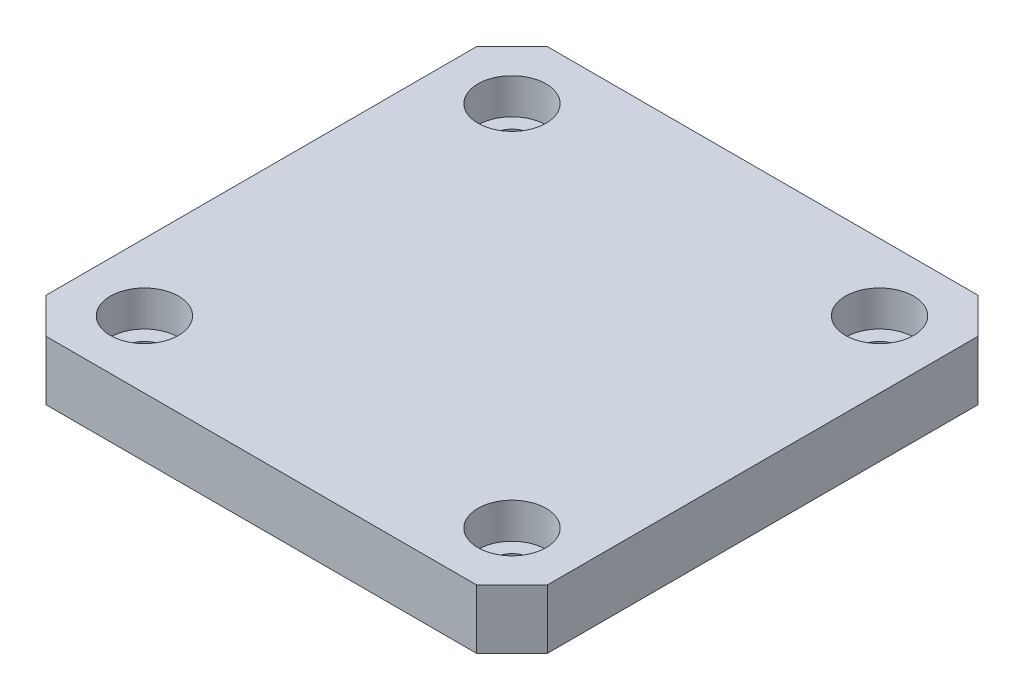
ISO-10303-21;
HEADER;
FILE_DESCRIPTION(('STEP AP214'),'2;1');
FILE_NAME('part.step','',(''),(''),'','','');
FILE_SCHEMA(('AUTOMOTIVE_DESIGN { 1 0 10303 214 1 1 1 1 }'));
ENDSEC;
DATA;
#1=APPLICATION_CONTEXT('core data for automotive mechanical design processes');
#2=APPLICATION_PROTOCOL_DEFINITION('international standard','automotive_design',2000,#1);
#3=PRODUCT_CONTEXT('',#1,'mechanical');
#4=PRODUCT('Part','Part','',(#3));
#5=PRODUCT_RELATED_PRODUCT_CATEGORY('part','',(#4));
#6=PRODUCT_DEFINITION_FORMATION('','',#4);
#7=PRODUCT_DEFINITION_CONTEXT('part definition',#1,'design');
#8=PRODUCT_DEFINITION('design','',#6,#7);
#9=PRODUCT_DEFINITION_SHAPE('','',#8);
#10=(LENGTH_UNIT() NAMED_UNIT(*) SI_UNIT(.MILLI.,.METRE.));
#11=(NAMED_UNIT(*) PLANE_ANGLE_UNIT() SI_UNIT($,.RADIAN.));
#12=(NAMED_UNIT(*) SI_UNIT($,.STERADIAN.) SOLID_ANGLE_UNIT());
#13=UNCERTAINTY_MEASURE_WITH_UNIT(LENGTH_MEASURE(1.E-05),#10,'distance_accuracy_value','');
#14=(GEOMETRIC_REPRESENTATION_CONTEXT(3) GLOBAL_UNCERTAINTY_ASSIGNED_CONTEXT((#13)) GLOBAL_UNIT_ASSIGNED_CONTEXT((#10,
#11,#12)) REPRESENTATION_CONTEXT('',''));
#15=CARTESIAN_POINT('',(0.,0.,0.));
#16=DIRECTION('',(0.,0.,1.));
#17=DIRECTION('',(1.,0.,0.));
#18=AXIS2_PLACEMENT_3D('',#15,#16,#17);
#19=CARTESIAN_POINT('',(0.,48.,0.));
#20=DIRECTION('',(0.,1.,0.));
#21=DIRECTION('',(1.,0.,0.));
#22=AXIS2_PLACEMENT_3D('',#19,#20,#21);
#23=PLANE('',#22);
#24=CARTESIAN_POINT('',(0.,48.,0.));
#25=DIRECTION('',(0.,1.,0.));
#26=DIRECTION('',(1.,0.,0.));
#27=AXIS2_PLACEMENT_3D('',#24,#25,#26);
#28=CIRCLE('',#27,11.);
#29=CARTESIAN_POINT('',(-11.,48.,0.));
#30=VERTEX_POINT('',#29);
#31=EDGE_CURVE('E272',#30,#30,#28,.T.);
#32=ORIENTED_EDGE('',*,*,#31,.T.);
#33=EDGE_LOOP('',(#32));
#34=FACE_BOUND('',#33,.T.);
#35=CARTESIAN_POINT('',(-15.5,48.,15.5));
#36=DIRECTION('',(0.,1.,0.));
#37=DIRECTION('',(0.,0.,1.));
#38=AXIS2_PLACEMENT_3D('',#35,#36,#37);
#39=CIRCLE('',#38,1.6);
#40=CARTESIAN_POINT('',(-15.5,48.,17.1));
#41=VERTEX_POINT('',#40);
#42=CARTESIAN_POINT('',(-15.5,48.,13.9));
#43=VERTEX_POINT('',#42);
#44=EDGE_CURVE('E319',#41,#43,#39,.T.);
#45=ORIENTED_EDGE('',*,*,#44,.T.);
#46=CARTESIAN_POINT('',(-15.5,48.,15.5));
#47=DIRECTION('',(0.,1.,0.));
#48=DIRECTION('',(0.,0.,1.));
#49=AXIS2_PLACEMENT_3D('',#46,#47,#48);
#50=CIRCLE('',#49,1.6);
#51=EDGE_CURVE('E276',#43,#41,#50,.T.);
#52=ORIENTED_EDGE('',*,*,#51,.T.);
#53=EDGE_LOOP('',(#45,#52));
#54=FACE_BOUND('',#53,.T.);
#55=CARTESIAN_POINT('',(-15.5,48.,-15.5));
#56=DIRECTION('',(0.,1.,0.));
#57=DIRECTION('',(0.,0.,1.));
#58=AXIS2_PLACEMENT_3D('',#55,#56,#57);
#59=CIRCLE('',#58,1.6);
#60=CARTESIAN_POINT('',(-15.5,48.,-13.9));
#61=VERTEX_POINT('',#60);
#62=CARTESIAN_POINT('',(-15.5,48.,-17.1));
#63=VERTEX_POINT('',#62);
#64=EDGE_CURVE('E294',#61,#63,#59,.T.);
#65=ORIENTED_EDGE('',*,*,#64,.T.);
#66=CARTESIAN_POINT('',(-15.5,48.,-15.5));
#67=DIRECTION('',(0.,1.,0.));
#68=DIRECTION('',(0.,0.,1.));
#69=AXIS2_PLACEMENT_3D('',#66,#67,#68);
#70=CIRCLE('',#69,1.6);
#71=EDGE_CURVE('E396',#63,#61,#70,.T.);
#72=ORIENTED_EDGE('',*,*,#71,.T.);
#73=EDGE_LOOP('',(#65,#72));
#74=FACE_BOUND('',#73,.T.);
#75=CARTESIAN_POINT('',(15.5,48.,15.5));
#76=DIRECTION('',(0.,1.,0.));
#77=DIRECTION('',(0.,0.,1.));
#78=AXIS2_PLACEMENT_3D('',#75,#76,#77);
#79=CIRCLE('',#78,1.6);
#80=CARTESIAN_POINT('',(15.5,48.,17.1));
#81=VERTEX_POINT('',#80);
#82=CARTESIAN_POINT('',(15.5,48.,13.9));
#83=VERTEX_POINT('',#82);
#84=EDGE_CURVE('E265',#81,#83,#79,.T.);
#85=ORIENTED_EDGE('',*,*,#84,.T.);
#86=CARTESIAN_POINT('',(15.5,48.,15.5));
#87=DIRECTION('',(0.,1.,0.));
#88=DIRECTION('',(0.,0.,1.));
#89=AXIS2_PLACEMENT_3D('',#86,#87,#88);
#90=CIRCLE('',#89,1.6);
#91=EDGE_CURVE('E261',#83,#81,#90,.T.);
#92=ORIENTED_EDGE('',*,*,#91,.T.);
#93=EDGE_LOOP('',(#85,#92));
#94=FACE_BOUND('',#93,.T.);
#95=CARTESIAN_POINT('',(15.5,48.,-15.5));
#96=DIRECTION('',(0.,1.,0.));
#97=DIRECTION('',(0.,0.,1.));
#98=AXIS2_PLACEMENT_3D('',#95,#96,#97);
#99=CIRCLE('',#98,1.6);
#100=CARTESIAN_POINT('',(15.5,48.,-13.9));
#101=VERTEX_POINT('',#100);
#102=CARTESIAN_POINT('',(15.5,48.,-17.1));
#103=VERTEX_POINT('',#102);
#104=EDGE_CURVE('E368',#101,#103,#99,.T.);
#105=ORIENTED_EDGE('',*,*,#104,.T.);
#106=CARTESIAN_POINT('',(15.5,48.,-15.5));
#107=DIRECTION('',(0.,1.,0.));
#108=DIRECTION('',(0.,0.,1.));
#109=AXIS2_PLACEMENT_3D('',#106,#107,#108);
#110=CIRCLE('',#109,1.6);
#111=EDGE_CURVE('E342',#103,#101,#110,.T.);
#112=ORIENTED_EDGE('',*,*,#111,.T.);
#113=EDGE_LOOP('',(#105,#112));
#114=FACE_BOUND('',#113,.T.);
#115=DIRECTION('',(0.,0.,-1.));
#116=VECTOR('',#115,1.);
#117=CARTESIAN_POINT('',(21.15,48.,18.15));
#118=LINE('',#117,#116);
#119=CARTESIAN_POINT('',(21.15,48.,18.15));
#120=VERTEX_POINT('',#119);
#121=CARTESIAN_POINT('',(21.15,48.,-18.15));
#122=VERTEX_POINT('',#121);
#123=EDGE_CURVE('E27',#120,#122,#118,.T.);
#124=ORIENTED_EDGE('',*,*,#123,.F.);
#125=DIRECTION('',(0.707106781186531,0.,-0.707106781186564));
#126=VECTOR('',#125,1.);
#127=CARTESIAN_POINT('',(18.15,48.,21.15));
#128=LINE('',#127,#126);
#129=CARTESIAN_POINT('',(18.15,48.,21.15));
#130=VERTEX_POINT('',#129);
#131=EDGE_CURVE('E215',#130,#120,#128,.T.);
#132=ORIENTED_EDGE('',*,*,#131,.F.);
#133=DIRECTION('',(1.,0.,0.));
#134=VECTOR('',#133,1.);
#135=CARTESIAN_POINT('',(-18.15,48.,21.15));
#136=LINE('',#135,#134);
#137=CARTESIAN_POINT('',(-18.15,48.,21.15));
#138=VERTEX_POINT('',#137);
#139=EDGE_CURVE('E290',#138,#130,#136,.T.);
#140=ORIENTED_EDGE('',*,*,#139,.F.);
#141=DIRECTION('',(0.707106781186548,0.,0.707106781186548));
#142=VECTOR('',#141,1.);
#143=CARTESIAN_POINT('',(-21.15,48.,18.15));
#144=LINE('',#143,#142);
#145=CARTESIAN_POINT('',(-21.15,48.,18.15));
#146=VERTEX_POINT('',#145);
#147=EDGE_CURVE('E277',#146,#138,#144,.T.);
#148=ORIENTED_EDGE('',*,*,#147,.F.);
#149=DIRECTION('',(0.,0.,1.));
#150=VECTOR('',#149,1.);
#151=CARTESIAN_POINT('',(-21.15,48.,-18.15));
#152=LINE('',#151,#150);
#153=CARTESIAN_POINT('',(-21.15,48.,-18.15));
#154=VERTEX_POINT('',#153);
#155=EDGE_CURVE('E363',#154,#146,#152,.T.);
#156=ORIENTED_EDGE('',*,*,#155,.F.);
#157=DIRECTION('',(-0.707106781186548,0.,0.707106781186548));
#158=VECTOR('',#157,1.);
#159=CARTESIAN_POINT('',(-18.15,48.,-21.15));
#160=LINE('',#159,#158);
#161=CARTESIAN_POINT('',(-18.15,48.,-21.15));
#162=VERTEX_POINT('',#161);
#163=EDGE_CURVE('E297',#162,#154,#160,.T.);
#164=ORIENTED_EDGE('',*,*,#163,.F.);
#165=DIRECTION('',(-1.,0.,0.));
#166=VECTOR('',#165,1.);
#167=CARTESIAN_POINT('',(18.15,48.,-21.15));
#168=LINE('',#167,#166);
#169=CARTESIAN_POINT('',(18.15,48.,-21.15));
#170=VERTEX_POINT('',#169);
#171=EDGE_CURVE('E247',#170,#162,#168,.T.);
#172=ORIENTED_EDGE('',*,*,#171,.F.);
#173=DIRECTION('',(-0.707106781186531,0.,-0.707106781186564));
#174=VECTOR('',#173,1.);
#175=CARTESIAN_POINT('',(21.15,48.,-18.15));
#176=LINE('',#175,#174);
#177=EDGE_CURVE('E172',#122,#170,#176,.T.);
#178=ORIENTED_EDGE('',*,*,#177,.F.);
#179=EDGE_LOOP('',(#124,#132,#140,#148,#156,#164,#172,#178));
#180=FACE_BOUND('',#179,.T.);
#181=ADVANCED_FACE('F16',(#34,#54,#74,#94,#114,#180),#23,.F.);
#182=CARTESIAN_POINT('',(0.,53.,0.));
#183=DIRECTION('',(0.,1.,0.));
#184=DIRECTION('',(1.,0.,0.));
#185=AXIS2_PLACEMENT_3D('',#182,#183,#184);
#186=PLANE('',#185);
#187=CARTESIAN_POINT('',(-15.5,53.,15.5));
#188=DIRECTION('',(0.,-1.,0.));
#189=DIRECTION('',(0.,0.,1.));
#190=AXIS2_PLACEMENT_3D('',#187,#188,#189);
#191=CIRCLE('',#190,2.875);
#192=CARTESIAN_POINT('',(-15.5,53.,18.375));
#193=VERTEX_POINT('',#192);
#194=CARTESIAN_POINT('',(-15.5,53.,12.625));
#195=VERTEX_POINT('',#194);
#196=EDGE_CURVE('E266',#193,#195,#191,.T.);
#197=ORIENTED_EDGE('',*,*,#196,.T.);
#198=CARTESIAN_POINT('',(-15.5,53.,15.5));
#199=DIRECTION('',(0.,-1.,0.));
#200=DIRECTION('',(0.,0.,1.));
#201=AXIS2_PLACEMENT_3D('',#198,#199,#200);
#202=CIRCLE('',#201,2.875);
#203=EDGE_CURVE('E270',#195,#193,#202,.T.);
#204=ORIENTED_EDGE('',*,*,#203,.T.);
#205=EDGE_LOOP('',(#197,#204));
#206=FACE_BOUND('',#205,.T.);
#207=CARTESIAN_POINT('',(-15.5,53.,-15.5));
#208=DIRECTION('',(0.,-1.,0.));
#209=DIRECTION('',(0.,0.,1.));
#210=AXIS2_PLACEMENT_3D('',#207,#208,#209);
#211=CIRCLE('',#210,2.875);
#212=CARTESIAN_POINT('',(-15.5,53.,-12.625));
#213=VERTEX_POINT('',#212);
#214=CARTESIAN_POINT('',(-15.5,53.,-18.375));
#215=VERTEX_POINT('',#214);
#216=EDGE_CURVE('E336',#213,#215,#211,.T.);
#217=ORIENTED_EDGE('',*,*,#216,.T.);
#218=CARTESIAN_POINT('',(-15.5,53.,-15.5));
#219=DIRECTION('',(0.,-1.,0.));
#220=DIRECTION('',(0.,0.,1.));
#221=AXIS2_PLACEMENT_3D('',#218,#219,#220);
#222=CIRCLE('',#221,2.875);
#223=EDGE_CURVE('E333',#215,#213,#222,.T.);
#224=ORIENTED_EDGE('',*,*,#223,.T.);
#225=EDGE_LOOP('',(#217,#224));
#226=FACE_BOUND('',#225,.T.);
#227=CARTESIAN_POINT('',(15.5,53.,15.5));
#228=DIRECTION('',(0.,-1.,0.));
#229=DIRECTION('',(0.,0.,1.));
#230=AXIS2_PLACEMENT_3D('',#227,#228,#229);
#231=CIRCLE('',#230,2.875);
#232=CARTESIAN_POINT('',(15.5,53.,18.375));
#233=VERTEX_POINT('',#232);
#234=CARTESIAN_POINT('',(15.5,53.,12.625));
#235=VERTEX_POINT('',#234);
#236=EDGE_CURVE('E250',#233,#235,#231,.T.);
#237=ORIENTED_EDGE('',*,*,#236,.T.);
#238=CARTESIAN_POINT('',(15.5,53.,15.5));
#239=DIRECTION('',(0.,-1.,0.));
#240=DIRECTION('',(0.,0.,1.));
#241=AXIS2_PLACEMENT_3D('',#238,#239,#240);
#242=CIRCLE('',#241,2.875);
#243=EDGE_CURVE('E254',#235,#233,#242,.T.);
#244=ORIENTED_EDGE('',*,*,#243,.T.);
#245=EDGE_LOOP('',(#237,#244));
#246=FACE_BOUND('',#245,.T.);
#247=CARTESIAN_POINT('',(15.5,53.,-15.5));
#248=DIRECTION('',(0.,-1.,0.));
#249=DIRECTION('',(0.,0.,1.));
#250=AXIS2_PLACEMENT_3D('',#247,#248,#249);
#251=CIRCLE('',#250,2.875);
#252=CARTESIAN_POINT('',(15.5,53.,-12.625));
#253=VERTEX_POINT('',#252);
#254=CARTESIAN_POINT('',(15.5,53.,-18.375));
#255=VERTEX_POINT('',#254);
#256=EDGE_CURVE('E282',#253,#255,#251,.T.);
#257=ORIENTED_EDGE('',*,*,#256,.T.);
#258=CARTESIAN_POINT('',(15.5,53.,-15.5));
#259=DIRECTION('',(0.,-1.,0.));
#260=DIRECTION('',(0.,0.,1.));
#261=AXIS2_PLACEMENT_3D('',#258,#259,#260);
#262=CIRCLE('',#261,2.875);
#263=EDGE_CURVE('E20',#255,#253,#262,.T.);
#264=ORIENTED_EDGE('',*,*,#263,.T.);
#265=EDGE_LOOP('',(#257,#264));
#266=FACE_BOUND('',#265,.T.);
#267=DIRECTION('',(0.,0.,-1.));
#268=VECTOR('',#267,1.);
#269=CARTESIAN_POINT('',(21.15,53.,18.15));
#270=LINE('',#269,#268);
#271=CARTESIAN_POINT('',(21.15,53.,18.15));
#272=VERTEX_POINT('',#271);
#273=CARTESIAN_POINT('',(21.15,53.,-18.15));
#274=VERTEX_POINT('',#273);
#275=EDGE_CURVE('E11',#272,#274,#270,.T.);
#276=ORIENTED_EDGE('',*,*,#275,.T.);
#277=DIRECTION('',(-0.707106781186531,0.,-0.707106781186564));
#278=VECTOR('',#277,1.);
#279=CARTESIAN_POINT('',(21.15,53.,-18.15));
#280=LINE('',#279,#278);
#281=CARTESIAN_POINT('',(18.15,53.,-21.15));
#282=VERTEX_POINT('',#281);
#283=EDGE_CURVE('E332',#274,#282,#280,.T.);
#284=ORIENTED_EDGE('',*,*,#283,.T.);
#285=DIRECTION('',(-1.,0.,0.));
#286=VECTOR('',#285,1.);
#287=CARTESIAN_POINT('',(18.15,53.,-21.15));
#288=LINE('',#287,#286);
#289=CARTESIAN_POINT('',(-18.15,53.,-21.15));
#290=VERTEX_POINT('',#289);
#291=EDGE_CURVE('E184',#282,#290,#288,.T.);
#292=ORIENTED_EDGE('',*,*,#291,.T.);
#293=DIRECTION('',(-0.707106781186548,0.,0.707106781186548));
#294=VECTOR('',#293,1.);
#295=CARTESIAN_POINT('',(-18.15,53.,-21.15));
#296=LINE('',#295,#294);
#297=CARTESIAN_POINT('',(-21.15,53.,-18.15));
#298=VERTEX_POINT('',#297);
#299=EDGE_CURVE('E248',#290,#298,#296,.T.);
#300=ORIENTED_EDGE('',*,*,#299,.T.);
#301=DIRECTION('',(0.,0.,1.));
#302=VECTOR('',#301,1.);
#303=CARTESIAN_POINT('',(-21.15,53.,-18.15));
#304=LINE('',#303,#302);
#305=CARTESIAN_POINT('',(-21.15,53.,18.15));
#306=VERTEX_POINT('',#305);
#307=EDGE_CURVE('E366',#298,#306,#304,.T.);
#308=ORIENTED_EDGE('',*,*,#307,.T.);
#309=DIRECTION('',(0.707106781186548,0.,0.707106781186548));
#310=VECTOR('',#309,1.);
#311=CARTESIAN_POINT('',(-21.15,53.,18.15));
#312=LINE('',#311,#310);
#313=CARTESIAN_POINT('',(-18.15,53.,21.15));
#314=VERTEX_POINT('',#313);
#315=EDGE_CURVE('E280',#306,#314,#312,.T.);
#316=ORIENTED_EDGE('',*,*,#315,.T.);
#317=DIRECTION('',(1.,0.,0.));
#318=VECTOR('',#317,1.);
#319=CARTESIAN_POINT('',(-18.15,53.,21.15));
#320=LINE('',#319,#318);
#321=CARTESIAN_POINT('',(18.15,53.,21.15));
#322=VERTEX_POINT('',#321);
#323=EDGE_CURVE('E287',#314,#322,#320,.T.);
#324=ORIENTED_EDGE('',*,*,#323,.T.);
#325=DIRECTION('',(0.707106781186531,0.,-0.707106781186564));
#326=VECTOR('',#325,1.);
#327=CARTESIAN_POINT('',(18.15,53.,21.15));
#328=LINE('',#327,#326);
#329=EDGE_CURVE('E227',#322,#272,#328,.T.);
#330=ORIENTED_EDGE('',*,*,#329,.T.);
#331=EDGE_LOOP('',(#276,#284,#292,#300,#308,#316,#324,#330));
#332=FACE_BOUND('',#331,.T.);
#333=ADVANCED_FACE('F432',(#206,#226,#246,#266,#332),#186,.T.);
#334=CARTESIAN_POINT('',(21.15,48.,18.15));
#335=DIRECTION('',(1.,0.,0.));
#336=DIRECTION('',(0.,1.,0.));
#337=AXIS2_PLACEMENT_3D('',#334,#335,#336);
#338=PLANE('',#337);
#339=ORIENTED_EDGE('',*,*,#123,.T.);
#340=DIRECTION('',(0.,1.,0.));
#341=VECTOR('',#340,1.);
#342=CARTESIAN_POINT('',(21.15,48.,-18.15));
#343=LINE('',#342,#341);
#344=EDGE_CURVE('E219',#122,#274,#343,.T.);
#345=ORIENTED_EDGE('',*,*,#344,.T.);
#346=ORIENTED_EDGE('',*,*,#275,.F.);
#347=DIRECTION('',(0.,1.,0.));
#348=VECTOR('',#347,1.);
#349=CARTESIAN_POINT('',(21.15,48.,18.15));
#350=LINE('',#349,#348);
#351=EDGE_CURVE('E222',#120,#272,#350,.T.);
#352=ORIENTED_EDGE('',*,*,#351,.F.);
#353=EDGE_LOOP('',(#339,#345,#346,#352));
#354=FACE_BOUND('',#353,.T.);
#355=ADVANCED_FACE('F223',(#354),#338,.T.);
#356=CARTESIAN_POINT('',(21.15,48.,-18.15));
#357=DIRECTION('',(0.707106781186564,0.,-0.707106781186531));
#358=DIRECTION('',(0.,-1.,0.));
#359=AXIS2_PLACEMENT_3D('',#356,#357,#358);
#360=PLANE('',#359);
#361=ORIENTED_EDGE('',*,*,#177,.T.);
#362=DIRECTION('',(0.,1.,0.));
#363=VECTOR('',#362,1.);
#364=CARTESIAN_POINT('',(18.15,48.,-21.15));
#365=LINE('',#364,#363);
#366=EDGE_CURVE('E303',#170,#282,#365,.T.);
#367=ORIENTED_EDGE('',*,*,#366,.T.);
#368=ORIENTED_EDGE('',*,*,#283,.F.);
#369=ORIENTED_EDGE('',*,*,#344,.F.);
#370=EDGE_LOOP('',(#361,#367,#368,#369));
#371=FACE_BOUND('',#370,.T.);
#372=ADVANCED_FACE('F431',(#371),#360,.T.);
#373=CARTESIAN_POINT('',(18.15,48.,-21.15));
#374=DIRECTION('',(0.,0.,-1.));
#375=DIRECTION('',(0.,-1.,0.));
#376=AXIS2_PLACEMENT_3D('',#373,#374,#375);
#377=PLANE('',#376);
#378=ORIENTED_EDGE('',*,*,#171,.T.);
#379=DIRECTION('',(0.,1.,0.));
#380=VECTOR('',#379,1.);
#381=CARTESIAN_POINT('',(-18.15,48.,-21.15));
#382=LINE('',#381,#380);
#383=EDGE_CURVE('E245',#162,#290,#382,.T.);
#384=ORIENTED_EDGE('',*,*,#383,.T.);
#385=ORIENTED_EDGE('',*,*,#291,.F.);
#386=ORIENTED_EDGE('',*,*,#366,.F.);
#387=EDGE_LOOP('',(#378,#384,#385,#386));
#388=FACE_BOUND('',#387,.T.);
#389=ADVANCED_FACE('F18',(#388),#377,.T.);
#390=CARTESIAN_POINT('',(-18.15,48.,-21.15));
#391=DIRECTION('',(-0.707106781186548,0.,-0.707106781186548));
#392=DIRECTION('',(-0.707106781186548,0.,0.707106781186548));
#393=AXIS2_PLACEMENT_3D('',#390,#391,#392);
#394=PLANE('',#393);
#395=ORIENTED_EDGE('',*,*,#163,.T.);
#396=DIRECTION('',(0.,1.,0.));
#397=VECTOR('',#396,1.);
#398=CARTESIAN_POINT('',(-21.15,48.,-18.15));
#399=LINE('',#398,#397);
#400=EDGE_CURVE('E300',#154,#298,#399,.T.);
#401=ORIENTED_EDGE('',*,*,#400,.T.);
#402=ORIENTED_EDGE('',*,*,#299,.F.);
#403=ORIENTED_EDGE('',*,*,#383,.F.);
#404=EDGE_LOOP('',(#395,#401,#402,#403));
#405=FACE_BOUND('',#404,.T.);
#406=ADVANCED_FACE('F483',(#405),#394,.T.);
#407=CARTESIAN_POINT('',(-21.15,48.,-18.15));
#408=DIRECTION('',(-1.,0.,0.));
#409=DIRECTION('',(0.,0.,1.));
#410=AXIS2_PLACEMENT_3D('',#407,#408,#409);
#411=PLANE('',#410);
#412=ORIENTED_EDGE('',*,*,#155,.T.);
#413=DIRECTION('',(0.,1.,0.));
#414=VECTOR('',#413,1.);
#415=CARTESIAN_POINT('',(-21.15,48.,18.15));
#416=LINE('',#415,#414);
#417=EDGE_CURVE('E367',#146,#306,#416,.T.);
#418=ORIENTED_EDGE('',*,*,#417,.T.);
#419=ORIENTED_EDGE('',*,*,#307,.F.);
#420=ORIENTED_EDGE('',*,*,#400,.F.);
#421=EDGE_LOOP('',(#412,#418,#419,#420));
#422=FACE_BOUND('',#421,.T.);
#423=ADVANCED_FACE('F479',(#422),#411,.T.);
#424=CARTESIAN_POINT('',(-21.15,48.,18.15));
#425=DIRECTION('',(-0.707106781186548,0.,0.707106781186548));
#426=DIRECTION('',(0.,1.,0.));
#427=AXIS2_PLACEMENT_3D('',#424,#425,#426);
#428=PLANE('',#427);
#429=ORIENTED_EDGE('',*,*,#147,.T.);
#430=DIRECTION('',(0.,1.,0.));
#431=VECTOR('',#430,1.);
#432=CARTESIAN_POINT('',(-18.15,48.,21.15));
#433=LINE('',#432,#431);
#434=EDGE_CURVE('E281',#138,#314,#433,.T.);
#435=ORIENTED_EDGE('',*,*,#434,.T.);
#436=ORIENTED_EDGE('',*,*,#315,.F.);
#437=ORIENTED_EDGE('',*,*,#417,.F.);
#438=EDGE_LOOP('',(#429,#435,#436,#437));
#439=FACE_BOUND('',#438,.T.);
#440=ADVANCED_FACE('F482',(#439),#428,.T.);
#441=CARTESIAN_POINT('',(-18.15,48.,21.15));
#442=DIRECTION('',(0.,0.,1.));
#443=DIRECTION('',(1.,0.,0.));
#444=AXIS2_PLACEMENT_3D('',#441,#442,#443);
#445=PLANE('',#444);
#446=ORIENTED_EDGE('',*,*,#139,.T.);
#447=DIRECTION('',(0.,1.,0.));
#448=VECTOR('',#447,1.);
#449=CARTESIAN_POINT('',(18.15,48.,21.15));
#450=LINE('',#449,#448);
#451=EDGE_CURVE('E232',#130,#322,#450,.T.);
#452=ORIENTED_EDGE('',*,*,#451,.T.);
#453=ORIENTED_EDGE('',*,*,#323,.F.);
#454=ORIENTED_EDGE('',*,*,#434,.F.);
#455=EDGE_LOOP('',(#446,#452,#453,#454));
#456=FACE_BOUND('',#455,.T.);
#457=ADVANCED_FACE('F492',(#456),#445,.T.);
#458=CARTESIAN_POINT('',(18.15,48.,21.15));
#459=DIRECTION('',(0.707106781186564,0.,0.707106781186531));
#460=DIRECTION('',(0.,-1.,0.));
#461=AXIS2_PLACEMENT_3D('',#458,#459,#460);
#462=PLANE('',#461);
#463=ORIENTED_EDGE('',*,*,#131,.T.);
#464=ORIENTED_EDGE('',*,*,#351,.T.);
#465=ORIENTED_EDGE('',*,*,#329,.F.);
#466=ORIENTED_EDGE('',*,*,#451,.F.);
#467=EDGE_LOOP('',(#463,#464,#465,#466));
#468=FACE_BOUND('',#467,.T.);
#469=ADVANCED_FACE('F230',(#468),#462,.T.);
#470=CARTESIAN_POINT('',(0.,50.,0.));
#471=DIRECTION('',(0.,1.,0.));
#472=DIRECTION('',(1.,0.,0.));
#473=AXIS2_PLACEMENT_3D('',#470,#471,#472);
#474=PLANE('',#473);
#475=CARTESIAN_POINT('',(0.,50.,0.));
#476=DIRECTION('',(0.,1.,0.));
#477=DIRECTION('',(1.,0.,0.));
#478=AXIS2_PLACEMENT_3D('',#475,#476,#477);
#479=CIRCLE('',#478,11.);
#480=CARTESIAN_POINT('',(-11.,50.,0.));
#481=VERTEX_POINT('',#480);
#482=EDGE_CURVE('E234',#481,#481,#479,.T.);
#483=ORIENTED_EDGE('',*,*,#482,.F.);
#484=EDGE_LOOP('',(#483));
#485=FACE_BOUND('',#484,.T.);
#486=ADVANCED_FACE('F497',(#485),#474,.F.);
#487=CARTESIAN_POINT('',(0.,48.,0.));
#488=DIRECTION('',(0.,1.,0.));
#489=DIRECTION('',(1.,0.,0.));
#490=AXIS2_PLACEMENT_3D('',#487,#488,#489);
#491=CYLINDRICAL_SURFACE('',#490,11.);
#492=ORIENTED_EDGE('',*,*,#31,.F.);
#493=DIRECTION('',(0.,1.,0.));
#494=VECTOR('',#493,1.);
#495=CARTESIAN_POINT('',(-11.,48.,0.));
#496=LINE('',#495,#494);
#497=EDGE_CURVE('E240',#30,#481,#496,.T.);
#498=ORIENTED_EDGE('',*,*,#497,.T.);
#499=ORIENTED_EDGE('',*,*,#482,.T.);
#500=ORIENTED_EDGE('',*,*,#497,.F.);
#501=EDGE_LOOP('',(#492,#498,#499,#500));
#502=FACE_BOUND('',#501,.T.);
#503=ADVANCED_FACE('F447',(#502),#491,.F.);
#504=CARTESIAN_POINT('',(-15.5,50.5,15.5));
#505=DIRECTION('',(0.,-1.,0.));
#506=DIRECTION('',(0.,0.,1.));
#507=AXIS2_PLACEMENT_3D('',#504,#505,#506);
#508=CYLINDRICAL_SURFACE('',#507,1.6);
#509=CARTESIAN_POINT('',(-15.5,50.,15.5));
#510=DIRECTION('',(0.,-1.,0.));
#511=DIRECTION('',(0.,0.,1.));
#512=AXIS2_PLACEMENT_3D('',#509,#510,#511);
#513=CIRCLE('',#512,1.6);
#514=CARTESIAN_POINT('',(-15.5,50.,13.9));
#515=VERTEX_POINT('',#514);
#516=EDGE_CURVE('E271',#515,#515,#513,.T.);
#517=ORIENTED_EDGE('',*,*,#516,.F.);
#518=DIRECTION('',(0.,-1.,0.));
#519=VECTOR('',#518,1.);
#520=CARTESIAN_POINT('',(-15.5,50.5,13.9));
#521=LINE('',#520,#519);
#522=EDGE_CURVE('E323',#515,#43,#521,.T.);
#523=ORIENTED_EDGE('',*,*,#522,.T.);
#524=ORIENTED_EDGE('',*,*,#44,.F.);
#525=ORIENTED_EDGE('',*,*,#51,.F.);
#526=ORIENTED_EDGE('',*,*,#522,.F.);
#527=EDGE_LOOP('',(#517,#523,#524,#525,#526));
#528=FACE_BOUND('',#527,.T.);
#529=ADVANCED_FACE('F466',(#528),#508,.F.);
#530=CARTESIAN_POINT('',(-15.5,51.5,15.5));
#531=DIRECTION('',(0.,-1.,0.));
#532=DIRECTION('',(0.,0.,1.));
#533=AXIS2_PLACEMENT_3D('',#530,#531,#532);
#534=CYLINDRICAL_SURFACE('',#533,2.875);
#535=ORIENTED_EDGE('',*,*,#196,.F.);
#536=ORIENTED_EDGE('',*,*,#203,.F.);
#537=DIRECTION('',(0.,-1.,0.));
#538=VECTOR('',#537,1.);
#539=CARTESIAN_POINT('',(-15.5,51.5,12.625));
#540=LINE('',#539,#538);
#541=CARTESIAN_POINT('',(-15.5,50.,12.625));
#542=VERTEX_POINT('',#541);
#543=EDGE_CURVE('E410',#195,#542,#540,.T.);
#544=ORIENTED_EDGE('',*,*,#543,.T.);
#545=CARTESIAN_POINT('',(-15.5,50.,15.5));
#546=DIRECTION('',(0.,-1.,0.));
#547=DIRECTION('',(0.,0.,1.));
#548=AXIS2_PLACEMENT_3D('',#545,#546,#547);
#549=CIRCLE('',#548,2.875);
#550=CARTESIAN_POINT('',(-15.5,50.,18.375));
#551=VERTEX_POINT('',#550);
#552=EDGE_CURVE('E355',#542,#551,#549,.T.);
#553=ORIENTED_EDGE('',*,*,#552,.T.);
#554=CARTESIAN_POINT('',(-15.5,50.,15.5));
#555=DIRECTION('',(0.,-1.,0.));
#556=DIRECTION('',(0.,0.,1.));
#557=AXIS2_PLACEMENT_3D('',#554,#555,#556);
#558=CIRCLE('',#557,2.875);
#559=EDGE_CURVE('E392',#551,#542,#558,.T.);
#560=ORIENTED_EDGE('',*,*,#559,.T.);
#561=ORIENTED_EDGE('',*,*,#543,.F.);
#562=EDGE_LOOP('',(#535,#536,#544,#553,#560,#561));
#563=FACE_BOUND('',#562,.T.);
#564=ADVANCED_FACE('F462',(#563),#534,.F.);
#565=CARTESIAN_POINT('',(-15.5,50.,15.5));
#566=DIRECTION('',(0.,-1.,0.));
#567=DIRECTION('',(0.,0.,-1.));
#568=AXIS2_PLACEMENT_3D('',#565,#566,#567);
#569=PLANE('',#568);
#570=ORIENTED_EDGE('',*,*,#516,.T.);
#571=EDGE_LOOP('',(#570));
#572=FACE_BOUND('',#571,.T.);
#573=ORIENTED_EDGE('',*,*,#559,.F.);
#574=ORIENTED_EDGE('',*,*,#552,.F.);
#575=EDGE_LOOP('',(#573,#574));
#576=FACE_BOUND('',#575,.T.);
#577=ADVANCED_FACE('F459',(#572,#576),#569,.F.);
#578=CARTESIAN_POINT('',(-15.5,50.5,-15.5));
#579=DIRECTION('',(0.,-1.,0.));
#580=DIRECTION('',(0.,0.,1.));
#581=AXIS2_PLACEMENT_3D('',#578,#579,#580);
#582=CYLINDRICAL_SURFACE('',#581,1.6);
#583=CARTESIAN_POINT('',(-15.5,50.,-15.5));
#584=DIRECTION('',(0.,-1.,0.));
#585=DIRECTION('',(0.,0.,1.));
#586=AXIS2_PLACEMENT_3D('',#583,#584,#585);
#587=CIRCLE('',#586,1.6);
#588=CARTESIAN_POINT('',(-15.5,50.,-17.1));
#589=VERTEX_POINT('',#588);
#590=EDGE_CURVE('E310',#589,#589,#587,.T.);
#591=ORIENTED_EDGE('',*,*,#590,.F.);
#592=DIRECTION('',(0.,-1.,0.));
#593=VECTOR('',#592,1.);
#594=CARTESIAN_POINT('',(-15.5,50.5,-17.1));
#595=LINE('',#594,#593);
#596=EDGE_CURVE('E291',#589,#63,#595,.T.);
#597=ORIENTED_EDGE('',*,*,#596,.T.);
#598=ORIENTED_EDGE('',*,*,#64,.F.);
#599=ORIENTED_EDGE('',*,*,#71,.F.);
#600=ORIENTED_EDGE('',*,*,#596,.F.);
#601=EDGE_LOOP('',(#591,#597,#598,#599,#600));
#602=FACE_BOUND('',#601,.T.);
#603=ADVANCED_FACE('F457',(#602),#582,.F.);
#604=CARTESIAN_POINT('',(-15.5,51.5,-15.5));
#605=DIRECTION('',(0.,-1.,0.));
#606=DIRECTION('',(0.,0.,1.));
#607=AXIS2_PLACEMENT_3D('',#604,#605,#606);
#608=CYLINDRICAL_SURFACE('',#607,2.875);
#609=ORIENTED_EDGE('',*,*,#216,.F.);
#610=ORIENTED_EDGE('',*,*,#223,.F.);
#611=DIRECTION('',(0.,-1.,0.));
#612=VECTOR('',#611,1.);
#613=CARTESIAN_POINT('',(-15.5,51.5,-18.375));
#614=LINE('',#613,#612);
#615=CARTESIAN_POINT('',(-15.5,50.,-18.375));
#616=VERTEX_POINT('',#615);
#617=EDGE_CURVE('E295',#215,#616,#614,.T.);
#618=ORIENTED_EDGE('',*,*,#617,.T.);
#619=CARTESIAN_POINT('',(-15.5,50.,-15.5));
#620=DIRECTION('',(0.,-1.,0.));
#621=DIRECTION('',(0.,0.,1.));
#622=AXIS2_PLACEMENT_3D('',#619,#620,#621);
#623=CIRCLE('',#622,2.875);
#624=CARTESIAN_POINT('',(-15.5,50.,-12.625));
#625=VERTEX_POINT('',#624);
#626=EDGE_CURVE('E260',#616,#625,#623,.T.);
#627=ORIENTED_EDGE('',*,*,#626,.T.);
#628=CARTESIAN_POINT('',(-15.5,50.,-15.5));
#629=DIRECTION('',(0.,-1.,0.));
#630=DIRECTION('',(0.,0.,1.));
#631=AXIS2_PLACEMENT_3D('',#628,#629,#630);
#632=CIRCLE('',#631,2.875);
#633=EDGE_CURVE('E256',#625,#616,#632,.T.);
#634=ORIENTED_EDGE('',*,*,#633,.T.);
#635=ORIENTED_EDGE('',*,*,#617,.F.);
#636=EDGE_LOOP('',(#609,#610,#618,#627,#634,#635));
#637=FACE_BOUND('',#636,.T.);
#638=ADVANCED_FACE('F453',(#637),#608,.F.);
#639=CARTESIAN_POINT('',(-15.5,50.,-15.5));
#640=DIRECTION('',(0.,-1.,0.));
#641=DIRECTION('',(0.,0.,-1.));
#642=AXIS2_PLACEMENT_3D('',#639,#640,#641);
#643=PLANE('',#642);
#644=ORIENTED_EDGE('',*,*,#590,.T.);
#645=EDGE_LOOP('',(#644));
#646=FACE_BOUND('',#645,.T.);
#647=ORIENTED_EDGE('',*,*,#633,.F.);
#648=ORIENTED_EDGE('',*,*,#626,.F.);
#649=EDGE_LOOP('',(#647,#648));
#650=FACE_BOUND('',#649,.T.);
#651=ADVANCED_FACE('F456',(#646,#650),#643,.F.);
#652=CARTESIAN_POINT('',(15.5,50.5,15.5));
#653=DIRECTION('',(0.,-1.,0.));
#654=DIRECTION('',(0.,0.,1.));
#655=AXIS2_PLACEMENT_3D('',#652,#653,#654);
#656=CYLINDRICAL_SURFACE('',#655,1.6);
#657=CARTESIAN_POINT('',(15.5,50.,15.5));
#658=DIRECTION('',(0.,-1.,0.));
#659=DIRECTION('',(0.,0.,1.));
#660=AXIS2_PLACEMENT_3D('',#657,#658,#659);
#661=CIRCLE('',#660,1.6);
#662=CARTESIAN_POINT('',(15.5,50.,13.9));
#663=VERTEX_POINT('',#662);
#664=EDGE_CURVE('E255',#663,#663,#661,.T.);
#665=ORIENTED_EDGE('',*,*,#664,.F.);
#666=DIRECTION('',(0.,-1.,0.));
#667=VECTOR('',#666,1.);
#668=CARTESIAN_POINT('',(15.5,50.5,13.9));
#669=LINE('',#668,#667);
#670=EDGE_CURVE('E314',#663,#83,#669,.T.);
#671=ORIENTED_EDGE('',*,*,#670,.T.);
#672=ORIENTED_EDGE('',*,*,#84,.F.);
#673=ORIENTED_EDGE('',*,*,#91,.F.);
#674=ORIENTED_EDGE('',*,*,#670,.F.);
#675=EDGE_LOOP('',(#665,#671,#672,#673,#674));
#676=FACE_BOUND('',#675,.T.);
#677=ADVANCED_FACE('F470',(#676),#656,.F.);
#678=CARTESIAN_POINT('',(15.5,51.5,15.5));
#679=DIRECTION('',(0.,-1.,0.));
#680=DIRECTION('',(0.,0.,1.));
#681=AXIS2_PLACEMENT_3D('',#678,#679,#680);
#682=CYLINDRICAL_SURFACE('',#681,2.875);
#683=ORIENTED_EDGE('',*,*,#236,.F.);
#684=ORIENTED_EDGE('',*,*,#243,.F.);
#685=DIRECTION('',(0.,-1.,0.));
#686=VECTOR('',#685,1.);
#687=CARTESIAN_POINT('',(15.5,51.5,12.625));
#688=LINE('',#687,#686);
#689=CARTESIAN_POINT('',(15.5,50.,12.625));
#690=VERTEX_POINT('',#689);
#691=EDGE_CURVE('E318',#235,#690,#688,.T.);
#692=ORIENTED_EDGE('',*,*,#691,.T.);
#693=CARTESIAN_POINT('',(15.5,50.,15.5));
#694=DIRECTION('',(0.,-1.,0.));
#695=DIRECTION('',(0.,0.,1.));
#696=AXIS2_PLACEMENT_3D('',#693,#694,#695);
#697=CIRCLE('',#696,2.875);
#698=CARTESIAN_POINT('',(15.5,50.,18.375));
#699=VERTEX_POINT('',#698);
#700=EDGE_CURVE('E326',#690,#699,#697,.T.);
#701=ORIENTED_EDGE('',*,*,#700,.T.);
#702=CARTESIAN_POINT('',(15.5,50.,15.5));
#703=DIRECTION('',(0.,-1.,0.));
#704=DIRECTION('',(0.,0.,1.));
#705=AXIS2_PLACEMENT_3D('',#702,#703,#704);
#706=CIRCLE('',#705,2.875);
#707=EDGE_CURVE('E329',#699,#690,#706,.T.);
#708=ORIENTED_EDGE('',*,*,#707,.T.);
#709=ORIENTED_EDGE('',*,*,#691,.F.);
#710=EDGE_LOOP('',(#683,#684,#692,#701,#708,#709));
#711=FACE_BOUND('',#710,.T.);
#712=ADVANCED_FACE('F485',(#711),#682,.F.);
#713=CARTESIAN_POINT('',(15.5,50.,15.5));
#714=DIRECTION('',(0.,-1.,0.));
#715=DIRECTION('',(0.,0.,-1.));
#716=AXIS2_PLACEMENT_3D('',#713,#714,#715);
#717=PLANE('',#716);
#718=ORIENTED_EDGE('',*,*,#664,.T.);
#719=EDGE_LOOP('',(#718));
#720=FACE_BOUND('',#719,.T.);
#721=ORIENTED_EDGE('',*,*,#707,.F.);
#722=ORIENTED_EDGE('',*,*,#700,.F.);
#723=EDGE_LOOP('',(#721,#722));
#724=FACE_BOUND('',#723,.T.);
#725=ADVANCED_FACE('F488',(#720,#724),#717,.F.);
#726=CARTESIAN_POINT('',(15.5,50.5,-15.5));
#727=DIRECTION('',(0.,-1.,0.));
#728=DIRECTION('',(0.,0.,1.));
#729=AXIS2_PLACEMENT_3D('',#726,#727,#728);
#730=CYLINDRICAL_SURFACE('',#729,1.6);
#731=CARTESIAN_POINT('',(15.5,50.,-15.5));
#732=DIRECTION('',(0.,-1.,0.));
#733=DIRECTION('',(0.,0.,1.));
#734=AXIS2_PLACEMENT_3D('',#731,#732,#733);
#735=CIRCLE('',#734,1.6);
#736=CARTESIAN_POINT('',(15.5,50.,-17.1));
#737=VERTEX_POINT('',#736);
#738=EDGE_CURVE('E286',#737,#737,#735,.T.);
#739=ORIENTED_EDGE('',*,*,#738,.F.);
#740=DIRECTION('',(0.,-1.,0.));
#741=VECTOR('',#740,1.);
#742=CARTESIAN_POINT('',(15.5,50.5,-17.1));
#743=LINE('',#742,#741);
#744=EDGE_CURVE('E372',#737,#103,#743,.T.);
#745=ORIENTED_EDGE('',*,*,#744,.T.);
#746=ORIENTED_EDGE('',*,*,#104,.F.);
#747=ORIENTED_EDGE('',*,*,#111,.F.);
#748=ORIENTED_EDGE('',*,*,#744,.F.);
#749=EDGE_LOOP('',(#739,#745,#746,#747,#748));
#750=FACE_BOUND('',#749,.T.);
#751=ADVANCED_FACE('F477',(#750),#730,.F.);
#752=CARTESIAN_POINT('',(15.5,51.5,-15.5));
#753=DIRECTION('',(0.,-1.,0.));
#754=DIRECTION('',(0.,0.,1.));
#755=AXIS2_PLACEMENT_3D('',#752,#753,#754);
#756=CYLINDRICAL_SURFACE('',#755,2.875);
#757=ORIENTED_EDGE('',*,*,#256,.F.);
#758=ORIENTED_EDGE('',*,*,#263,.F.);
#759=DIRECTION('',(0.,-1.,0.));
#760=VECTOR('',#759,1.);
#761=CARTESIAN_POINT('',(15.5,51.5,-18.375));
#762=LINE('',#761,#760);
#763=CARTESIAN_POINT('',(15.5,50.,-18.375));
#764=VERTEX_POINT('',#763);
#765=EDGE_CURVE('E244',#255,#764,#762,.T.);
#766=ORIENTED_EDGE('',*,*,#765,.T.);
#767=CARTESIAN_POINT('',(15.5,50.,-15.5));
#768=DIRECTION('',(0.,-1.,0.));
#769=DIRECTION('',(0.,0.,1.));
#770=AXIS2_PLACEMENT_3D('',#767,#768,#769);
#771=CIRCLE('',#770,2.875);
#772=CARTESIAN_POINT('',(15.5,50.,-12.625));
#773=VERTEX_POINT('',#772);
#774=EDGE_CURVE('E304',#764,#773,#771,.T.);
#775=ORIENTED_EDGE('',*,*,#774,.T.);
#776=CARTESIAN_POINT('',(15.5,50.,-15.5));
#777=DIRECTION('',(0.,-1.,0.));
#778=DIRECTION('',(0.,0.,1.));
#779=AXIS2_PLACEMENT_3D('',#776,#777,#778);
#780=CIRCLE('',#779,2.875);
#781=EDGE_CURVE('E307',#773,#764,#780,.T.);
#782=ORIENTED_EDGE('',*,*,#781,.T.);
#783=ORIENTED_EDGE('',*,*,#765,.F.);
#784=EDGE_LOOP('',(#757,#758,#766,#775,#782,#783));
#785=FACE_BOUND('',#784,.T.);
#786=ADVANCED_FACE('F451',(#785),#756,.F.);
#787=CARTESIAN_POINT('',(15.5,50.,-15.5));
#788=DIRECTION('',(0.,-1.,0.));
#789=DIRECTION('',(0.,0.,-1.));
#790=AXIS2_PLACEMENT_3D('',#787,#788,#789);
#791=PLANE('',#790);
#792=ORIENTED_EDGE('',*,*,#738,.T.);
#793=EDGE_LOOP('',(#792));
#794=FACE_BOUND('',#793,.T.);
#795=ORIENTED_EDGE('',*,*,#781,.F.);
#796=ORIENTED_EDGE('',*,*,#774,.F.);
#797=EDGE_LOOP('',(#795,#796));
#798=FACE_BOUND('',#797,.T.);
#799=ADVANCED_FACE('F448',(#794,#798),#791,.F.);
#800=CLOSED_SHELL('',(#181,#333,#355,#372,#389,#406,#423,#440,#457,#469,#486,#503,#529,#564,
#577,#603,#638,#651,#677,#712,#725,#751,#786,#799));
#801=MANIFOLD_SOLID_BREP('B1',#800);
#802=ADVANCED_BREP_SHAPE_REPRESENTATION('',(#18,#801),#14);
#803=SHAPE_DEFINITION_REPRESENTATION(#9,#802);
ENDSEC;
END-ISO-10303-21;
